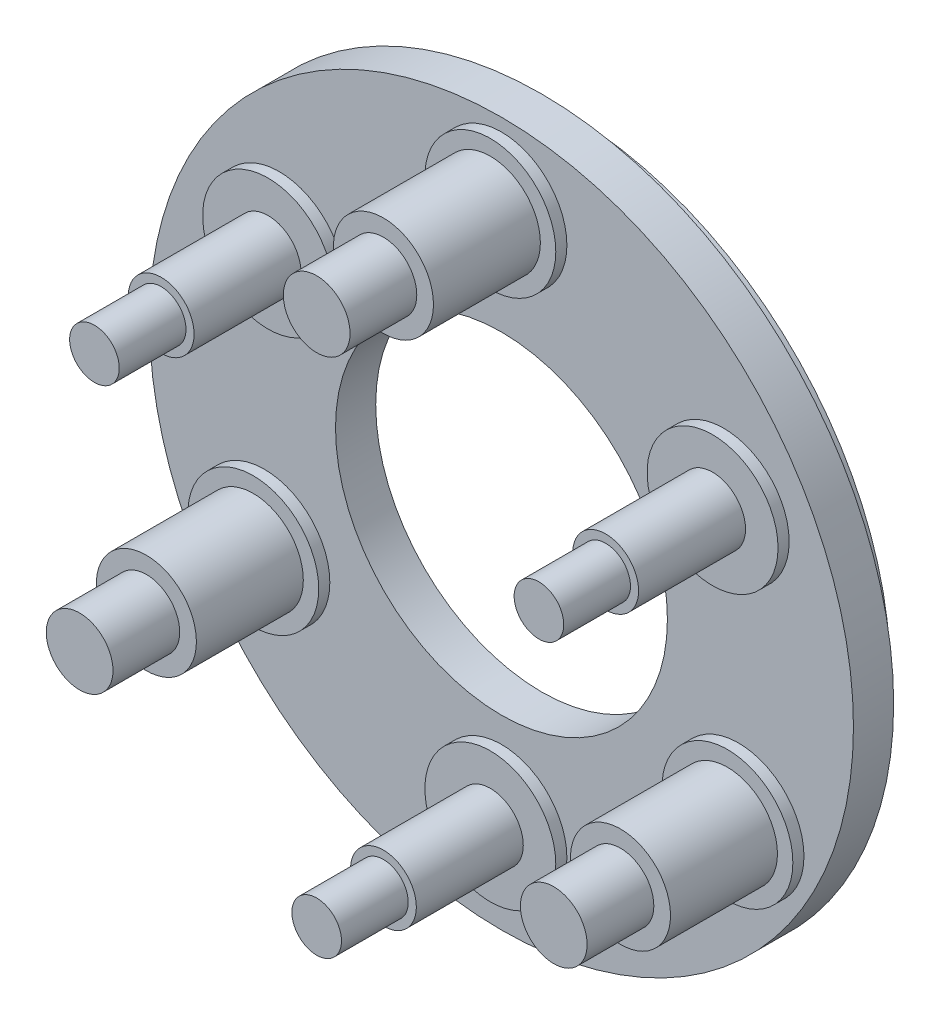
ISO-10303-21;
HEADER;
FILE_DESCRIPTION(('STEP AP214'),'2;1');
FILE_NAME('part.step','',(''),(''),'','','');
FILE_SCHEMA(('AUTOMOTIVE_DESIGN { 1 0 10303 214 1 1 1 1 }'));
ENDSEC;
DATA;
#1=APPLICATION_CONTEXT('core data for automotive mechanical design processes');
#2=APPLICATION_PROTOCOL_DEFINITION('international standard','automotive_design',2000,#1);
#3=PRODUCT_CONTEXT('',#1,'mechanical');
#4=PRODUCT('Part','Part','',(#3));
#5=PRODUCT_RELATED_PRODUCT_CATEGORY('part','',(#4));
#6=PRODUCT_DEFINITION_FORMATION('','',#4);
#7=PRODUCT_DEFINITION_CONTEXT('part definition',#1,'design');
#8=PRODUCT_DEFINITION('design','',#6,#7);
#9=PRODUCT_DEFINITION_SHAPE('','',#8);
#10=(LENGTH_UNIT() NAMED_UNIT(*) SI_UNIT(.MILLI.,.METRE.));
#11=(NAMED_UNIT(*) PLANE_ANGLE_UNIT() SI_UNIT($,.RADIAN.));
#12=(NAMED_UNIT(*) SI_UNIT($,.STERADIAN.) SOLID_ANGLE_UNIT());
#13=UNCERTAINTY_MEASURE_WITH_UNIT(LENGTH_MEASURE(1.E-05),#10,'distance_accuracy_value','');
#14=(GEOMETRIC_REPRESENTATION_CONTEXT(3) GLOBAL_UNCERTAINTY_ASSIGNED_CONTEXT((#13)) GLOBAL_UNIT_ASSIGNED_CONTEXT((#10,
#11,#12)) REPRESENTATION_CONTEXT('',''));
#15=CARTESIAN_POINT('',(0.,0.,0.));
#16=DIRECTION('',(0.,0.,1.));
#17=DIRECTION('',(1.,0.,0.));
#18=AXIS2_PLACEMENT_3D('',#15,#16,#17);
#19=CARTESIAN_POINT('',(0.,0.,0.));
#20=DIRECTION('',(0.,0.,1.));
#21=DIRECTION('',(1.,0.,0.));
#22=AXIS2_PLACEMENT_3D('',#19,#20,#21);
#23=PLANE('',#22);
#24=CARTESIAN_POINT('',(0.,0.,0.));
#25=DIRECTION('',(0.,0.,1.));
#26=DIRECTION('',(1.,0.,0.));
#27=AXIS2_PLACEMENT_3D('',#24,#25,#26);
#28=CIRCLE('',#27,4.9276);
#29=CARTESIAN_POINT('',(4.9276,0.,0.));
#30=VERTEX_POINT('',#29);
#31=EDGE_CURVE('E53',#30,#30,#28,.T.);
#32=ORIENTED_EDGE('',*,*,#31,.T.);
#33=EDGE_LOOP('',(#32));
#34=FACE_BOUND('',#33,.T.);
#35=CARTESIAN_POINT('',(0.,0.,0.));
#36=DIRECTION('',(0.,0.,-1.));
#37=DIRECTION('',(-1.,0.,0.));
#38=AXIS2_PLACEMENT_3D('',#35,#36,#37);
#39=CIRCLE('',#38,8.89);
#40=CARTESIAN_POINT('',(-8.89,0.,0.));
#41=VERTEX_POINT('',#40);
#42=EDGE_CURVE('E62',#41,#41,#39,.T.);
#43=ORIENTED_EDGE('',*,*,#42,.T.);
#44=EDGE_LOOP('',(#43));
#45=FACE_BOUND('',#44,.T.);
#46=ADVANCED_FACE('F35',(#34,#45),#23,.F.);
#47=CARTESIAN_POINT('',(0.,0.,1.1938));
#48=DIRECTION('',(0.,0.,1.));
#49=DIRECTION('',(1.,0.,0.));
#50=AXIS2_PLACEMENT_3D('',#47,#48,#49);
#51=PLANE('',#50);
#52=CARTESIAN_POINT('',(-6.59911357683746,3.80999999999994,1.1938));
#53=DIRECTION('',(0.,0.,1.));
#54=DIRECTION('',(-0.499999999999992,-0.866025403784443,0.));
#55=AXIS2_PLACEMENT_3D('',#52,#53,#54);
#56=CIRCLE('',#55,1.9431);
#57=CARTESIAN_POINT('',(-7.57066357683744,2.12722603790639,1.1938));
#58=VERTEX_POINT('',#57);
#59=EDGE_CURVE('E122',#58,#58,#56,.T.);
#60=ORIENTED_EDGE('',*,*,#59,.F.);
#61=EDGE_LOOP('',(#60));
#62=FACE_BOUND('',#61,.T.);
#63=CARTESIAN_POINT('',(7.03905448195995,-4.06399999999994,1.1938));
#64=DIRECTION('',(0.,0.,1.));
#65=DIRECTION('',(-0.499999999999992,-0.866025403784443,0.));
#66=AXIS2_PLACEMENT_3D('',#63,#64,#65);
#67=CIRCLE('',#66,1.9431);
#68=CARTESIAN_POINT('',(6.06750448195997,-5.74677396209349,1.1938));
#69=VERTEX_POINT('',#68);
#70=EDGE_CURVE('E116',#69,#69,#67,.T.);
#71=ORIENTED_EDGE('',*,*,#70,.F.);
#72=EDGE_LOOP('',(#71));
#73=FACE_BOUND('',#72,.T.);
#74=CARTESIAN_POINT('',(6.5991135768374,3.81000000000003,1.1938));
#75=DIRECTION('',(0.,0.,1.));
#76=DIRECTION('',(-0.500000000000004,0.866025403784436,0.));
#77=AXIS2_PLACEMENT_3D('',#74,#75,#76);
#78=CIRCLE('',#77,1.9431);
#79=CARTESIAN_POINT('',(5.6275635768374,5.49277396209357,1.1938));
#80=VERTEX_POINT('',#79);
#81=EDGE_CURVE('E110',#80,#80,#78,.T.);
#82=ORIENTED_EDGE('',*,*,#81,.F.);
#83=EDGE_LOOP('',(#82));
#84=FACE_BOUND('',#83,.T.);
#85=CARTESIAN_POINT('',(-7.0390544819599,-4.06400000000003,1.1938));
#86=DIRECTION('',(0.,0.,1.));
#87=DIRECTION('',(-0.500000000000004,0.866025403784436,0.));
#88=AXIS2_PLACEMENT_3D('',#85,#86,#87);
#89=CIRCLE('',#88,1.9431);
#90=CARTESIAN_POINT('',(-8.01060448195991,-2.38122603790649,1.1938));
#91=VERTEX_POINT('',#90);
#92=EDGE_CURVE('E104',#91,#91,#89,.T.);
#93=ORIENTED_EDGE('',*,*,#92,.F.);
#94=EDGE_LOOP('',(#93));
#95=FACE_BOUND('',#94,.T.);
#96=CARTESIAN_POINT('',(0.,-7.62,1.1938));
#97=DIRECTION('',(0.,0.,1.));
#98=DIRECTION('',(1.,0.,0.));
#99=AXIS2_PLACEMENT_3D('',#96,#97,#98);
#100=CIRCLE('',#99,1.9431);
#101=CARTESIAN_POINT('',(1.9431,-7.62,1.1938));
#102=VERTEX_POINT('',#101);
#103=EDGE_CURVE('E74',#102,#102,#100,.T.);
#104=ORIENTED_EDGE('',*,*,#103,.F.);
#105=EDGE_LOOP('',(#104));
#106=FACE_BOUND('',#105,.T.);
#107=CARTESIAN_POINT('',(0.,8.128,1.1938));
#108=DIRECTION('',(0.,0.,1.));
#109=DIRECTION('',(1.,0.,0.));
#110=AXIS2_PLACEMENT_3D('',#107,#108,#109);
#111=CIRCLE('',#110,1.9431);
#112=CARTESIAN_POINT('',(1.9431,8.128,1.1938));
#113=VERTEX_POINT('',#112);
#114=EDGE_CURVE('E68',#113,#113,#111,.T.);
#115=ORIENTED_EDGE('',*,*,#114,.F.);
#116=EDGE_LOOP('',(#115));
#117=FACE_BOUND('',#116,.T.);
#118=CARTESIAN_POINT('',(0.,0.,1.1938));
#119=DIRECTION('',(0.,0.,1.));
#120=DIRECTION('',(1.,0.,0.));
#121=AXIS2_PLACEMENT_3D('',#118,#119,#120);
#122=CIRCLE('',#121,10.4521);
#123=CARTESIAN_POINT('',(10.4521,0.,1.1938));
#124=VERTEX_POINT('',#123);
#125=EDGE_CURVE('E42',#124,#124,#122,.T.);
#126=ORIENTED_EDGE('',*,*,#125,.T.);
#127=EDGE_LOOP('',(#126));
#128=FACE_BOUND('',#127,.T.);
#129=CARTESIAN_POINT('',(0.,0.,1.1938));
#130=DIRECTION('',(0.,0.,1.));
#131=DIRECTION('',(1.,0.,0.));
#132=AXIS2_PLACEMENT_3D('',#129,#130,#131);
#133=CIRCLE('',#132,4.9276);
#134=CARTESIAN_POINT('',(4.9276,0.,1.1938));
#135=VERTEX_POINT('',#134);
#136=EDGE_CURVE('E51',#135,#135,#133,.T.);
#137=ORIENTED_EDGE('',*,*,#136,.F.);
#138=EDGE_LOOP('',(#137));
#139=FACE_BOUND('',#138,.T.);
#140=ADVANCED_FACE('F213',(#62,#73,#84,#95,#106,#117,#128,#139),#51,.T.);
#141=CARTESIAN_POINT('',(0.,0.,0.));
#142=DIRECTION('',(0.,0.,1.));
#143=DIRECTION('',(1.,0.,0.));
#144=AXIS2_PLACEMENT_3D('',#141,#142,#143);
#145=CIRCLE('',#144,9.6393);
#146=CARTESIAN_POINT('',(9.6393,0.,0.));
#147=VERTEX_POINT('',#146);
#148=EDGE_CURVE('E10',#147,#147,#145,.F.);
#149=ORIENTED_EDGE('',*,*,#148,.F.);
#150=EDGE_LOOP('',(#149));
#151=FACE_BOUND('',#150,.T.);
#152=CARTESIAN_POINT('',(0.,0.,0.));
#153=DIRECTION('',(0.,0.,1.));
#154=DIRECTION('',(1.,0.,0.));
#155=AXIS2_PLACEMENT_3D('',#152,#153,#154);
#156=CIRCLE('',#155,10.4521);
#157=CARTESIAN_POINT('',(10.4521,0.,0.));
#158=VERTEX_POINT('',#157);
#159=EDGE_CURVE('E46',#158,#158,#156,.T.);
#160=ORIENTED_EDGE('',*,*,#159,.F.);
#161=EDGE_LOOP('',(#160));
#162=FACE_BOUND('',#161,.T.);
#163=ADVANCED_FACE('F216',(#151,#162),#23,.F.);
#164=CARTESIAN_POINT('',(0.,0.,1.1938));
#165=DIRECTION('',(0.,0.,-1.));
#166=DIRECTION('',(-1.,0.,0.));
#167=AXIS2_PLACEMENT_3D('',#164,#165,#166);
#168=CYLINDRICAL_SURFACE('',#167,10.4521);
#169=ORIENTED_EDGE('',*,*,#125,.F.);
#170=EDGE_LOOP('',(#169));
#171=FACE_BOUND('',#170,.T.);
#172=ORIENTED_EDGE('',*,*,#159,.T.);
#173=EDGE_LOOP('',(#172));
#174=FACE_BOUND('',#173,.T.);
#175=ADVANCED_FACE('F37',(#171,#174),#168,.T.);
#176=CARTESIAN_POINT('',(0.,0.,1.1938));
#177=DIRECTION('',(0.,0.,-1.));
#178=DIRECTION('',(-1.,0.,0.));
#179=AXIS2_PLACEMENT_3D('',#176,#177,#178);
#180=CYLINDRICAL_SURFACE('',#179,4.9276);
#181=ORIENTED_EDGE('',*,*,#136,.T.);
#182=EDGE_LOOP('',(#181));
#183=FACE_BOUND('',#182,.T.);
#184=ORIENTED_EDGE('',*,*,#31,.F.);
#185=EDGE_LOOP('',(#184));
#186=FACE_BOUND('',#185,.T.);
#187=ADVANCED_FACE('F230',(#183,#186),#180,.F.);
#188=CARTESIAN_POINT('',(0.,0.,-0.7112));
#189=DIRECTION('',(0.,0.,-1.));
#190=DIRECTION('',(-1.,0.,0.));
#191=AXIS2_PLACEMENT_3D('',#188,#189,#190);
#192=PLANE('',#191);
#193=CARTESIAN_POINT('',(0.,0.,-0.7112));
#194=DIRECTION('',(0.,0.,-1.));
#195=DIRECTION('',(-1.,0.,0.));
#196=AXIS2_PLACEMENT_3D('',#193,#194,#195);
#197=CIRCLE('',#196,9.6393);
#198=CARTESIAN_POINT('',(-9.6393,0.,-0.7112));
#199=VERTEX_POINT('',#198);
#200=EDGE_CURVE('E56',#199,#199,#197,.T.);
#201=ORIENTED_EDGE('',*,*,#200,.T.);
#202=EDGE_LOOP('',(#201));
#203=FACE_BOUND('',#202,.T.);
#204=CARTESIAN_POINT('',(0.,0.,-0.7112));
#205=DIRECTION('',(0.,0.,-1.));
#206=DIRECTION('',(-1.,0.,0.));
#207=AXIS2_PLACEMENT_3D('',#204,#205,#206);
#208=CIRCLE('',#207,8.89);
#209=CARTESIAN_POINT('',(-8.89,0.,-0.7112));
#210=VERTEX_POINT('',#209);
#211=EDGE_CURVE('E61',#210,#210,#208,.T.);
#212=ORIENTED_EDGE('',*,*,#211,.F.);
#213=EDGE_LOOP('',(#212));
#214=FACE_BOUND('',#213,.T.);
#215=ADVANCED_FACE('F233',(#203,#214),#192,.T.);
#216=CARTESIAN_POINT('',(0.,0.,-0.7112));
#217=DIRECTION('',(0.,0.,1.));
#218=DIRECTION('',(1.,0.,0.));
#219=AXIS2_PLACEMENT_3D('',#216,#217,#218);
#220=CYLINDRICAL_SURFACE('',#219,9.6393);
#221=ORIENTED_EDGE('',*,*,#200,.F.);
#222=EDGE_LOOP('',(#221));
#223=FACE_BOUND('',#222,.T.);
#224=ORIENTED_EDGE('',*,*,#148,.T.);
#225=EDGE_LOOP('',(#224));
#226=FACE_BOUND('',#225,.T.);
#227=ADVANCED_FACE('F244',(#223,#226),#220,.T.);
#228=CARTESIAN_POINT('',(0.,0.,-0.7112));
#229=DIRECTION('',(0.,0.,1.));
#230=DIRECTION('',(1.,0.,0.));
#231=AXIS2_PLACEMENT_3D('',#228,#229,#230);
#232=CYLINDRICAL_SURFACE('',#231,8.89);
#233=ORIENTED_EDGE('',*,*,#211,.T.);
#234=EDGE_LOOP('',(#233));
#235=FACE_BOUND('',#234,.T.);
#236=ORIENTED_EDGE('',*,*,#42,.F.);
#237=EDGE_LOOP('',(#236));
#238=FACE_BOUND('',#237,.T.);
#239=ADVANCED_FACE('F241',(#235,#238),#232,.F.);
#240=CARTESIAN_POINT('',(0.,8.128,1.524));
#241=DIRECTION('',(0.,0.,-1.));
#242=DIRECTION('',(-1.,0.,0.));
#243=AXIS2_PLACEMENT_3D('',#240,#241,#242);
#244=CYLINDRICAL_SURFACE('',#243,1.9431);
#245=CARTESIAN_POINT('',(0.,8.128,1.524));
#246=DIRECTION('',(0.,0.,1.));
#247=DIRECTION('',(1.,0.,0.));
#248=AXIS2_PLACEMENT_3D('',#245,#246,#247);
#249=CIRCLE('',#248,1.9431);
#250=CARTESIAN_POINT('',(1.9431,8.128,1.524));
#251=VERTEX_POINT('',#250);
#252=EDGE_CURVE('E65',#251,#251,#249,.T.);
#253=ORIENTED_EDGE('',*,*,#252,.F.);
#254=EDGE_LOOP('',(#253));
#255=FACE_BOUND('',#254,.T.);
#256=ORIENTED_EDGE('',*,*,#114,.T.);
#257=EDGE_LOOP('',(#256));
#258=FACE_BOUND('',#257,.T.);
#259=ADVANCED_FACE('F243',(#255,#258),#244,.T.);
#260=CARTESIAN_POINT('',(0.,8.128,1.524));
#261=DIRECTION('',(0.,0.,1.));
#262=DIRECTION('',(1.,0.,0.));
#263=AXIS2_PLACEMENT_3D('',#260,#261,#262);
#264=PLANE('',#263);
#265=CARTESIAN_POINT('',(0.,8.128,1.524));
#266=DIRECTION('',(0.,0.,1.));
#267=DIRECTION('',(1.,0.,0.));
#268=AXIS2_PLACEMENT_3D('',#265,#266,#267);
#269=CIRCLE('',#268,1.4859);
#270=CARTESIAN_POINT('',(1.4859,8.128,1.524));
#271=VERTEX_POINT('',#270);
#272=EDGE_CURVE('E80',#271,#271,#269,.T.);
#273=ORIENTED_EDGE('',*,*,#272,.F.);
#274=EDGE_LOOP('',(#273));
#275=FACE_BOUND('',#274,.T.);
#276=ORIENTED_EDGE('',*,*,#252,.T.);
#277=EDGE_LOOP('',(#276));
#278=FACE_BOUND('',#277,.T.);
#279=ADVANCED_FACE('F251',(#275,#278),#264,.T.);
#280=CARTESIAN_POINT('',(0.,-7.62,1.524));
#281=DIRECTION('',(0.,0.,-1.));
#282=DIRECTION('',(-1.,0.,0.));
#283=AXIS2_PLACEMENT_3D('',#280,#281,#282);
#284=CYLINDRICAL_SURFACE('',#283,1.9431);
#285=CARTESIAN_POINT('',(0.,-7.62,1.524));
#286=DIRECTION('',(0.,0.,1.));
#287=DIRECTION('',(1.,0.,0.));
#288=AXIS2_PLACEMENT_3D('',#285,#286,#287);
#289=CIRCLE('',#288,1.9431);
#290=CARTESIAN_POINT('',(1.9431,-7.62,1.524));
#291=VERTEX_POINT('',#290);
#292=EDGE_CURVE('E71',#291,#291,#289,.T.);
#293=ORIENTED_EDGE('',*,*,#292,.F.);
#294=EDGE_LOOP('',(#293));
#295=FACE_BOUND('',#294,.T.);
#296=ORIENTED_EDGE('',*,*,#103,.T.);
#297=EDGE_LOOP('',(#296));
#298=FACE_BOUND('',#297,.T.);
#299=ADVANCED_FACE('F301',(#295,#298),#284,.T.);
#300=CARTESIAN_POINT('',(0.,-7.62,1.524));
#301=DIRECTION('',(0.,0.,1.));
#302=DIRECTION('',(1.,0.,0.));
#303=AXIS2_PLACEMENT_3D('',#300,#301,#302);
#304=PLANE('',#303);
#305=CARTESIAN_POINT('',(0.,-7.62,1.524));
#306=DIRECTION('',(0.,0.,1.));
#307=DIRECTION('',(1.,0.,0.));
#308=AXIS2_PLACEMENT_3D('',#305,#306,#307);
#309=CIRCLE('',#308,0.9779);
#310=CARTESIAN_POINT('',(0.977900000000002,-7.62,1.524));
#311=VERTEX_POINT('',#310);
#312=EDGE_CURVE('E86',#311,#311,#309,.T.);
#313=ORIENTED_EDGE('',*,*,#312,.F.);
#314=EDGE_LOOP('',(#313));
#315=FACE_BOUND('',#314,.T.);
#316=ORIENTED_EDGE('',*,*,#292,.T.);
#317=EDGE_LOOP('',(#316));
#318=FACE_BOUND('',#317,.T.);
#319=ADVANCED_FACE('F308',(#315,#318),#304,.T.);
#320=CARTESIAN_POINT('',(0.,8.128,4.699));
#321=DIRECTION('',(0.,0.,-1.));
#322=DIRECTION('',(-1.,0.,0.));
#323=AXIS2_PLACEMENT_3D('',#320,#321,#322);
#324=CYLINDRICAL_SURFACE('',#323,1.4859);
#325=CARTESIAN_POINT('',(0.,8.128,4.699));
#326=DIRECTION('',(0.,0.,1.));
#327=DIRECTION('',(1.,0.,0.));
#328=AXIS2_PLACEMENT_3D('',#325,#326,#327);
#329=CIRCLE('',#328,1.4859);
#330=CARTESIAN_POINT('',(1.4859,8.128,4.699));
#331=VERTEX_POINT('',#330);
#332=EDGE_CURVE('E77',#331,#331,#329,.T.);
#333=ORIENTED_EDGE('',*,*,#332,.F.);
#334=EDGE_LOOP('',(#333));
#335=FACE_BOUND('',#334,.T.);
#336=ORIENTED_EDGE('',*,*,#272,.T.);
#337=EDGE_LOOP('',(#336));
#338=FACE_BOUND('',#337,.T.);
#339=ADVANCED_FACE('F315',(#335,#338),#324,.T.);
#340=CARTESIAN_POINT('',(0.,8.128,4.699));
#341=DIRECTION('',(0.,0.,1.));
#342=DIRECTION('',(1.,0.,0.));
#343=AXIS2_PLACEMENT_3D('',#340,#341,#342);
#344=PLANE('',#343);
#345=CARTESIAN_POINT('',(0.,8.128,4.699));
#346=DIRECTION('',(0.,0.,1.));
#347=DIRECTION('',(1.,0.,0.));
#348=AXIS2_PLACEMENT_3D('',#345,#346,#347);
#349=CIRCLE('',#348,0.9906);
#350=CARTESIAN_POINT('',(0.9906,8.128,4.699));
#351=VERTEX_POINT('',#350);
#352=EDGE_CURVE('E92',#351,#351,#349,.T.);
#353=ORIENTED_EDGE('',*,*,#352,.F.);
#354=EDGE_LOOP('',(#353));
#355=FACE_BOUND('',#354,.T.);
#356=ORIENTED_EDGE('',*,*,#332,.T.);
#357=EDGE_LOOP('',(#356));
#358=FACE_BOUND('',#357,.T.);
#359=ADVANCED_FACE('F323',(#355,#358),#344,.T.);
#360=CARTESIAN_POINT('',(0.,-7.62,4.699));
#361=DIRECTION('',(0.,0.,-1.));
#362=DIRECTION('',(-1.,0.,0.));
#363=AXIS2_PLACEMENT_3D('',#360,#361,#362);
#364=CYLINDRICAL_SURFACE('',#363,0.9779);
#365=CARTESIAN_POINT('',(0.,-7.62,4.699));
#366=DIRECTION('',(0.,0.,1.));
#367=DIRECTION('',(1.,0.,0.));
#368=AXIS2_PLACEMENT_3D('',#365,#366,#367);
#369=CIRCLE('',#368,0.9779);
#370=CARTESIAN_POINT('',(0.977900000000002,-7.62,4.699));
#371=VERTEX_POINT('',#370);
#372=EDGE_CURVE('E83',#371,#371,#369,.T.);
#373=ORIENTED_EDGE('',*,*,#372,.F.);
#374=EDGE_LOOP('',(#373));
#375=FACE_BOUND('',#374,.T.);
#376=ORIENTED_EDGE('',*,*,#312,.T.);
#377=EDGE_LOOP('',(#376));
#378=FACE_BOUND('',#377,.T.);
#379=ADVANCED_FACE('F332',(#375,#378),#364,.T.);
#380=CARTESIAN_POINT('',(0.,-7.62,4.699));
#381=DIRECTION('',(0.,0.,1.));
#382=DIRECTION('',(1.,0.,0.));
#383=AXIS2_PLACEMENT_3D('',#380,#381,#382);
#384=PLANE('',#383);
#385=CARTESIAN_POINT('',(0.,-7.62,4.699));
#386=DIRECTION('',(0.,0.,1.));
#387=DIRECTION('',(1.,0.,0.));
#388=AXIS2_PLACEMENT_3D('',#385,#386,#387);
#389=CIRCLE('',#388,0.7366);
#390=CARTESIAN_POINT('',(0.736600000000002,-7.62,4.699));
#391=VERTEX_POINT('',#390);
#392=EDGE_CURVE('E98',#391,#391,#389,.T.);
#393=ORIENTED_EDGE('',*,*,#392,.F.);
#394=EDGE_LOOP('',(#393));
#395=FACE_BOUND('',#394,.T.);
#396=ORIENTED_EDGE('',*,*,#372,.T.);
#397=EDGE_LOOP('',(#396));
#398=FACE_BOUND('',#397,.T.);
#399=ADVANCED_FACE('F340',(#395,#398),#384,.T.);
#400=CARTESIAN_POINT('',(0.,8.128,6.6802));
#401=DIRECTION('',(0.,0.,-1.));
#402=DIRECTION('',(-1.,0.,0.));
#403=AXIS2_PLACEMENT_3D('',#400,#401,#402);
#404=CYLINDRICAL_SURFACE('',#403,0.9906);
#405=CARTESIAN_POINT('',(0.,8.128,6.6802));
#406=DIRECTION('',(0.,0.,1.));
#407=DIRECTION('',(1.,0.,0.));
#408=AXIS2_PLACEMENT_3D('',#405,#406,#407);
#409=CIRCLE('',#408,0.9906);
#410=CARTESIAN_POINT('',(0.9906,8.128,6.6802));
#411=VERTEX_POINT('',#410);
#412=EDGE_CURVE('E89',#411,#411,#409,.T.);
#413=ORIENTED_EDGE('',*,*,#412,.F.);
#414=EDGE_LOOP('',(#413));
#415=FACE_BOUND('',#414,.T.);
#416=ORIENTED_EDGE('',*,*,#352,.T.);
#417=EDGE_LOOP('',(#416));
#418=FACE_BOUND('',#417,.T.);
#419=ADVANCED_FACE('F347',(#415,#418),#404,.T.);
#420=CARTESIAN_POINT('',(0.,8.128,6.6802));
#421=DIRECTION('',(0.,0.,1.));
#422=DIRECTION('',(1.,0.,0.));
#423=AXIS2_PLACEMENT_3D('',#420,#421,#422);
#424=PLANE('',#423);
#425=ORIENTED_EDGE('',*,*,#412,.T.);
#426=EDGE_LOOP('',(#425));
#427=FACE_BOUND('',#426,.T.);
#428=ADVANCED_FACE('F355',(#427),#424,.T.);
#429=CARTESIAN_POINT('',(0.,-7.62,6.6802));
#430=DIRECTION('',(0.,0.,-1.));
#431=DIRECTION('',(-1.,0.,0.));
#432=AXIS2_PLACEMENT_3D('',#429,#430,#431);
#433=CYLINDRICAL_SURFACE('',#432,0.7366);
#434=CARTESIAN_POINT('',(0.,-7.62,6.6802));
#435=DIRECTION('',(0.,0.,1.));
#436=DIRECTION('',(1.,0.,0.));
#437=AXIS2_PLACEMENT_3D('',#434,#435,#436);
#438=CIRCLE('',#437,0.7366);
#439=CARTESIAN_POINT('',(0.736600000000002,-7.62,6.6802));
#440=VERTEX_POINT('',#439);
#441=EDGE_CURVE('E95',#440,#440,#438,.T.);
#442=ORIENTED_EDGE('',*,*,#441,.F.);
#443=EDGE_LOOP('',(#442));
#444=FACE_BOUND('',#443,.T.);
#445=ORIENTED_EDGE('',*,*,#392,.T.);
#446=EDGE_LOOP('',(#445));
#447=FACE_BOUND('',#446,.T.);
#448=ADVANCED_FACE('F363',(#444,#447),#433,.T.);
#449=CARTESIAN_POINT('',(0.,-7.62,6.6802));
#450=DIRECTION('',(0.,0.,1.));
#451=DIRECTION('',(1.,0.,0.));
#452=AXIS2_PLACEMENT_3D('',#449,#450,#451);
#453=PLANE('',#452);
#454=ORIENTED_EDGE('',*,*,#441,.T.);
#455=EDGE_LOOP('',(#454));
#456=FACE_BOUND('',#455,.T.);
#457=ADVANCED_FACE('F371',(#456),#453,.T.);
#458=CARTESIAN_POINT('',(-7.0390544819599,-4.06400000000003,1.524));
#459=DIRECTION('',(0.,0.,-1.));
#460=DIRECTION('',(-1.,0.,0.));
#461=AXIS2_PLACEMENT_3D('',#458,#459,#460);
#462=CYLINDRICAL_SURFACE('',#461,1.9431);
#463=CARTESIAN_POINT('',(-7.0390544819599,-4.06400000000003,1.524));
#464=DIRECTION('',(0.,0.,1.));
#465=DIRECTION('',(-0.500000000000004,0.866025403784436,0.));
#466=AXIS2_PLACEMENT_3D('',#463,#464,#465);
#467=CIRCLE('',#466,1.9431);
#468=CARTESIAN_POINT('',(-8.01060448195991,-2.38122603790649,1.524));
#469=VERTEX_POINT('',#468);
#470=EDGE_CURVE('E101',#469,#469,#467,.T.);
#471=ORIENTED_EDGE('',*,*,#470,.F.);
#472=EDGE_LOOP('',(#471));
#473=FACE_BOUND('',#472,.T.);
#474=ORIENTED_EDGE('',*,*,#92,.T.);
#475=EDGE_LOOP('',(#474));
#476=FACE_BOUND('',#475,.T.);
#477=ADVANCED_FACE('F379',(#473,#476),#462,.T.);
#478=CARTESIAN_POINT('',(-7.0390544819599,-4.06400000000003,1.524));
#479=DIRECTION('',(0.,0.,1.));
#480=DIRECTION('',(-0.500000000000004,0.866025403784436,0.));
#481=AXIS2_PLACEMENT_3D('',#478,#479,#480);
#482=PLANE('',#481);
#483=CARTESIAN_POINT('',(-7.0390544819599,-4.06400000000003,1.524));
#484=DIRECTION('',(0.,0.,1.));
#485=DIRECTION('',(-0.500000000000004,0.866025403784436,0.));
#486=AXIS2_PLACEMENT_3D('',#483,#484,#485);
#487=CIRCLE('',#486,1.4859);
#488=CARTESIAN_POINT('',(-7.78200448195991,-2.77717285251674,1.524));
#489=VERTEX_POINT('',#488);
#490=EDGE_CURVE('E128',#489,#489,#487,.T.);
#491=ORIENTED_EDGE('',*,*,#490,.F.);
#492=EDGE_LOOP('',(#491));
#493=FACE_BOUND('',#492,.T.);
#494=ORIENTED_EDGE('',*,*,#470,.T.);
#495=EDGE_LOOP('',(#494));
#496=FACE_BOUND('',#495,.T.);
#497=ADVANCED_FACE('F387',(#493,#496),#482,.T.);
#498=CARTESIAN_POINT('',(6.5991135768374,3.81000000000003,1.524));
#499=DIRECTION('',(0.,0.,-1.));
#500=DIRECTION('',(-1.,0.,0.));
#501=AXIS2_PLACEMENT_3D('',#498,#499,#500);
#502=CYLINDRICAL_SURFACE('',#501,1.9431);
#503=CARTESIAN_POINT('',(6.5991135768374,3.81000000000003,1.524));
#504=DIRECTION('',(0.,0.,1.));
#505=DIRECTION('',(-0.500000000000004,0.866025403784436,0.));
#506=AXIS2_PLACEMENT_3D('',#503,#504,#505);
#507=CIRCLE('',#506,1.9431);
#508=CARTESIAN_POINT('',(5.6275635768374,5.49277396209357,1.524));
#509=VERTEX_POINT('',#508);
#510=EDGE_CURVE('E107',#509,#509,#507,.T.);
#511=ORIENTED_EDGE('',*,*,#510,.F.);
#512=EDGE_LOOP('',(#511));
#513=FACE_BOUND('',#512,.T.);
#514=ORIENTED_EDGE('',*,*,#81,.T.);
#515=EDGE_LOOP('',(#514));
#516=FACE_BOUND('',#515,.T.);
#517=ADVANCED_FACE('F395',(#513,#516),#502,.T.);
#518=CARTESIAN_POINT('',(6.5991135768374,3.81000000000003,1.524));
#519=DIRECTION('',(0.,0.,1.));
#520=DIRECTION('',(-0.500000000000004,0.866025403784436,0.));
#521=AXIS2_PLACEMENT_3D('',#518,#519,#520);
#522=PLANE('',#521);
#523=CARTESIAN_POINT('',(6.5991135768374,3.81000000000003,1.524));
#524=DIRECTION('',(0.,0.,1.));
#525=DIRECTION('',(-0.500000000000004,0.866025403784436,0.));
#526=AXIS2_PLACEMENT_3D('',#523,#524,#525);
#527=CIRCLE('',#526,0.9779);
#528=CARTESIAN_POINT('',(6.1101635768374,4.65688624236083,1.524));
#529=VERTEX_POINT('',#528);
#530=EDGE_CURVE('E134',#529,#529,#527,.T.);
#531=ORIENTED_EDGE('',*,*,#530,.F.);
#532=EDGE_LOOP('',(#531));
#533=FACE_BOUND('',#532,.T.);
#534=ORIENTED_EDGE('',*,*,#510,.T.);
#535=EDGE_LOOP('',(#534));
#536=FACE_BOUND('',#535,.T.);
#537=ADVANCED_FACE('F403',(#533,#536),#522,.T.);
#538=CARTESIAN_POINT('',(7.03905448195995,-4.06399999999994,1.524));
#539=DIRECTION('',(0.,0.,-1.));
#540=DIRECTION('',(-1.,0.,0.));
#541=AXIS2_PLACEMENT_3D('',#538,#539,#540);
#542=CYLINDRICAL_SURFACE('',#541,1.9431);
#543=CARTESIAN_POINT('',(7.03905448195995,-4.06399999999994,1.524));
#544=DIRECTION('',(0.,0.,1.));
#545=DIRECTION('',(-0.499999999999992,-0.866025403784443,0.));
#546=AXIS2_PLACEMENT_3D('',#543,#544,#545);
#547=CIRCLE('',#546,1.9431);
#548=CARTESIAN_POINT('',(6.06750448195997,-5.74677396209349,1.524));
#549=VERTEX_POINT('',#548);
#550=EDGE_CURVE('E113',#549,#549,#547,.T.);
#551=ORIENTED_EDGE('',*,*,#550,.F.);
#552=EDGE_LOOP('',(#551));
#553=FACE_BOUND('',#552,.T.);
#554=ORIENTED_EDGE('',*,*,#70,.T.);
#555=EDGE_LOOP('',(#554));
#556=FACE_BOUND('',#555,.T.);
#557=ADVANCED_FACE('F411',(#553,#556),#542,.T.);
#558=CARTESIAN_POINT('',(7.03905448195995,-4.06399999999994,1.524));
#559=DIRECTION('',(0.,0.,1.));
#560=DIRECTION('',(-0.499999999999992,-0.866025403784443,0.));
#561=AXIS2_PLACEMENT_3D('',#558,#559,#560);
#562=PLANE('',#561);
#563=CARTESIAN_POINT('',(7.03905448195995,-4.06399999999994,1.524));
#564=DIRECTION('',(0.,0.,1.));
#565=DIRECTION('',(-0.499999999999992,-0.866025403784443,0.));
#566=AXIS2_PLACEMENT_3D('',#563,#564,#565);
#567=CIRCLE('',#566,1.4859);
#568=CARTESIAN_POINT('',(6.29610448195997,-5.35082714748324,1.524));
#569=VERTEX_POINT('',#568);
#570=EDGE_CURVE('E140',#569,#569,#567,.T.);
#571=ORIENTED_EDGE('',*,*,#570,.F.);
#572=EDGE_LOOP('',(#571));
#573=FACE_BOUND('',#572,.T.);
#574=ORIENTED_EDGE('',*,*,#550,.T.);
#575=EDGE_LOOP('',(#574));
#576=FACE_BOUND('',#575,.T.);
#577=ADVANCED_FACE('F209',(#573,#576),#562,.T.);
#578=CARTESIAN_POINT('',(-6.59911357683746,3.80999999999994,1.524));
#579=DIRECTION('',(0.,0.,-1.));
#580=DIRECTION('',(-1.,0.,0.));
#581=AXIS2_PLACEMENT_3D('',#578,#579,#580);
#582=CYLINDRICAL_SURFACE('',#581,1.9431);
#583=CARTESIAN_POINT('',(-6.59911357683746,3.80999999999994,1.524));
#584=DIRECTION('',(0.,0.,1.));
#585=DIRECTION('',(-0.499999999999992,-0.866025403784443,0.));
#586=AXIS2_PLACEMENT_3D('',#583,#584,#585);
#587=CIRCLE('',#586,1.9431);
#588=CARTESIAN_POINT('',(-7.57066357683744,2.12722603790639,1.524));
#589=VERTEX_POINT('',#588);
#590=EDGE_CURVE('E119',#589,#589,#587,.T.);
#591=ORIENTED_EDGE('',*,*,#590,.F.);
#592=EDGE_LOOP('',(#591));
#593=FACE_BOUND('',#592,.T.);
#594=ORIENTED_EDGE('',*,*,#59,.T.);
#595=EDGE_LOOP('',(#594));
#596=FACE_BOUND('',#595,.T.);
#597=ADVANCED_FACE('F203',(#593,#596),#582,.T.);
#598=CARTESIAN_POINT('',(-6.59911357683746,3.80999999999994,1.524));
#599=DIRECTION('',(0.,0.,1.));
#600=DIRECTION('',(-0.499999999999992,-0.866025403784443,0.));
#601=AXIS2_PLACEMENT_3D('',#598,#599,#600);
#602=PLANE('',#601);
#603=CARTESIAN_POINT('',(-6.59911357683746,3.80999999999994,1.524));
#604=DIRECTION('',(0.,0.,1.));
#605=DIRECTION('',(-0.499999999999992,-0.866025403784443,0.));
#606=AXIS2_PLACEMENT_3D('',#603,#604,#605);
#607=CIRCLE('',#606,0.9779);
#608=CARTESIAN_POINT('',(-7.08806357683745,2.96311375763913,1.524));
#609=VERTEX_POINT('',#608);
#610=EDGE_CURVE('E146',#609,#609,#607,.T.);
#611=ORIENTED_EDGE('',*,*,#610,.F.);
#612=EDGE_LOOP('',(#611));
#613=FACE_BOUND('',#612,.T.);
#614=ORIENTED_EDGE('',*,*,#590,.T.);
#615=EDGE_LOOP('',(#614));
#616=FACE_BOUND('',#615,.T.);
#617=ADVANCED_FACE('F199',(#613,#616),#602,.T.);
#618=CARTESIAN_POINT('',(-7.0390544819599,-4.06400000000003,4.699));
#619=DIRECTION('',(0.,0.,-1.));
#620=DIRECTION('',(-1.,0.,0.));
#621=AXIS2_PLACEMENT_3D('',#618,#619,#620);
#622=CYLINDRICAL_SURFACE('',#621,1.4859);
#623=CARTESIAN_POINT('',(-7.0390544819599,-4.06400000000003,4.699));
#624=DIRECTION('',(0.,0.,1.));
#625=DIRECTION('',(-0.500000000000004,0.866025403784436,0.));
#626=AXIS2_PLACEMENT_3D('',#623,#624,#625);
#627=CIRCLE('',#626,1.4859);
#628=CARTESIAN_POINT('',(-7.78200448195991,-2.77717285251674,4.699));
#629=VERTEX_POINT('',#628);
#630=EDGE_CURVE('E125',#629,#629,#627,.T.);
#631=ORIENTED_EDGE('',*,*,#630,.F.);
#632=EDGE_LOOP('',(#631));
#633=FACE_BOUND('',#632,.T.);
#634=ORIENTED_EDGE('',*,*,#490,.T.);
#635=EDGE_LOOP('',(#634));
#636=FACE_BOUND('',#635,.T.);
#637=ADVANCED_FACE('F202',(#633,#636),#622,.T.);
#638=CARTESIAN_POINT('',(-7.0390544819599,-4.06400000000003,4.699));
#639=DIRECTION('',(0.,0.,1.));
#640=DIRECTION('',(-0.500000000000004,0.866025403784436,0.));
#641=AXIS2_PLACEMENT_3D('',#638,#639,#640);
#642=PLANE('',#641);
#643=CARTESIAN_POINT('',(-7.0390544819599,-4.06400000000003,4.699));
#644=DIRECTION('',(0.,0.,1.));
#645=DIRECTION('',(-0.500000000000004,0.866025403784436,0.));
#646=AXIS2_PLACEMENT_3D('',#643,#644,#645);
#647=CIRCLE('',#646,0.9906);
#648=CARTESIAN_POINT('',(-7.5343544819599,-3.20611523501117,4.699));
#649=VERTEX_POINT('',#648);
#650=EDGE_CURVE('E152',#649,#649,#647,.T.);
#651=ORIENTED_EDGE('',*,*,#650,.F.);
#652=EDGE_LOOP('',(#651));
#653=FACE_BOUND('',#652,.T.);
#654=ORIENTED_EDGE('',*,*,#630,.T.);
#655=EDGE_LOOP('',(#654));
#656=FACE_BOUND('',#655,.T.);
#657=ADVANCED_FACE('F441',(#653,#656),#642,.T.);
#658=CARTESIAN_POINT('',(6.5991135768374,3.81000000000003,4.699));
#659=DIRECTION('',(0.,0.,-1.));
#660=DIRECTION('',(-1.,0.,0.));
#661=AXIS2_PLACEMENT_3D('',#658,#659,#660);
#662=CYLINDRICAL_SURFACE('',#661,0.9779);
#663=CARTESIAN_POINT('',(6.5991135768374,3.81000000000003,4.699));
#664=DIRECTION('',(0.,0.,1.));
#665=DIRECTION('',(-0.500000000000004,0.866025403784436,0.));
#666=AXIS2_PLACEMENT_3D('',#663,#664,#665);
#667=CIRCLE('',#666,0.9779);
#668=CARTESIAN_POINT('',(6.1101635768374,4.65688624236083,4.699));
#669=VERTEX_POINT('',#668);
#670=EDGE_CURVE('E131',#669,#669,#667,.T.);
#671=ORIENTED_EDGE('',*,*,#670,.F.);
#672=EDGE_LOOP('',(#671));
#673=FACE_BOUND('',#672,.T.);
#674=ORIENTED_EDGE('',*,*,#530,.T.);
#675=EDGE_LOOP('',(#674));
#676=FACE_BOUND('',#675,.T.);
#677=ADVANCED_FACE('F449',(#673,#676),#662,.T.);
#678=CARTESIAN_POINT('',(6.5991135768374,3.81000000000003,4.699));
#679=DIRECTION('',(0.,0.,1.));
#680=DIRECTION('',(-0.500000000000004,0.866025403784436,0.));
#681=AXIS2_PLACEMENT_3D('',#678,#679,#680);
#682=PLANE('',#681);
#683=CARTESIAN_POINT('',(6.5991135768374,3.81000000000003,4.699));
#684=DIRECTION('',(0.,0.,1.));
#685=DIRECTION('',(-0.500000000000004,0.866025403784436,0.));
#686=AXIS2_PLACEMENT_3D('',#683,#684,#685);
#687=CIRCLE('',#686,0.7366);
#688=CARTESIAN_POINT('',(6.2308135768374,4.44791431242765,4.699));
#689=VERTEX_POINT('',#688);
#690=EDGE_CURVE('E158',#689,#689,#687,.T.);
#691=ORIENTED_EDGE('',*,*,#690,.F.);
#692=EDGE_LOOP('',(#691));
#693=FACE_BOUND('',#692,.T.);
#694=ORIENTED_EDGE('',*,*,#670,.T.);
#695=EDGE_LOOP('',(#694));
#696=FACE_BOUND('',#695,.T.);
#697=ADVANCED_FACE('F457',(#693,#696),#682,.T.);
#698=CARTESIAN_POINT('',(7.03905448195995,-4.06399999999994,4.699));
#699=DIRECTION('',(0.,0.,-1.));
#700=DIRECTION('',(-1.,0.,0.));
#701=AXIS2_PLACEMENT_3D('',#698,#699,#700);
#702=CYLINDRICAL_SURFACE('',#701,1.4859);
#703=CARTESIAN_POINT('',(7.03905448195995,-4.06399999999994,4.699));
#704=DIRECTION('',(0.,0.,1.));
#705=DIRECTION('',(-0.499999999999992,-0.866025403784443,0.));
#706=AXIS2_PLACEMENT_3D('',#703,#704,#705);
#707=CIRCLE('',#706,1.4859);
#708=CARTESIAN_POINT('',(6.29610448195997,-5.35082714748324,4.699));
#709=VERTEX_POINT('',#708);
#710=EDGE_CURVE('E137',#709,#709,#707,.T.);
#711=ORIENTED_EDGE('',*,*,#710,.F.);
#712=EDGE_LOOP('',(#711));
#713=FACE_BOUND('',#712,.T.);
#714=ORIENTED_EDGE('',*,*,#570,.T.);
#715=EDGE_LOOP('',(#714));
#716=FACE_BOUND('',#715,.T.);
#717=ADVANCED_FACE('F465',(#713,#716),#702,.T.);
#718=CARTESIAN_POINT('',(7.03905448195995,-4.06399999999994,4.699));
#719=DIRECTION('',(0.,0.,1.));
#720=DIRECTION('',(-0.499999999999992,-0.866025403784443,0.));
#721=AXIS2_PLACEMENT_3D('',#718,#719,#720);
#722=PLANE('',#721);
#723=CARTESIAN_POINT('',(7.03905448195995,-4.06399999999994,4.699));
#724=DIRECTION('',(0.,0.,1.));
#725=DIRECTION('',(-0.499999999999992,-0.866025403784443,0.));
#726=AXIS2_PLACEMENT_3D('',#723,#724,#725);
#727=CIRCLE('',#726,0.9906);
#728=CARTESIAN_POINT('',(6.54375448195996,-4.9218847649888,4.699));
#729=VERTEX_POINT('',#728);
#730=EDGE_CURVE('E164',#729,#729,#727,.T.);
#731=ORIENTED_EDGE('',*,*,#730,.F.);
#732=EDGE_LOOP('',(#731));
#733=FACE_BOUND('',#732,.T.);
#734=ORIENTED_EDGE('',*,*,#710,.T.);
#735=EDGE_LOOP('',(#734));
#736=FACE_BOUND('',#735,.T.);
#737=ADVANCED_FACE('F195',(#733,#736),#722,.T.);
#738=CARTESIAN_POINT('',(-6.59911357683746,3.80999999999994,4.699));
#739=DIRECTION('',(0.,0.,-1.));
#740=DIRECTION('',(-1.,0.,0.));
#741=AXIS2_PLACEMENT_3D('',#738,#739,#740);
#742=CYLINDRICAL_SURFACE('',#741,0.9779);
#743=CARTESIAN_POINT('',(-6.59911357683746,3.80999999999994,4.699));
#744=DIRECTION('',(0.,0.,1.));
#745=DIRECTION('',(-0.499999999999992,-0.866025403784443,0.));
#746=AXIS2_PLACEMENT_3D('',#743,#744,#745);
#747=CIRCLE('',#746,0.9779);
#748=CARTESIAN_POINT('',(-7.08806357683745,2.96311375763913,4.699));
#749=VERTEX_POINT('',#748);
#750=EDGE_CURVE('E143',#749,#749,#747,.T.);
#751=ORIENTED_EDGE('',*,*,#750,.F.);
#752=EDGE_LOOP('',(#751));
#753=FACE_BOUND('',#752,.T.);
#754=ORIENTED_EDGE('',*,*,#610,.T.);
#755=EDGE_LOOP('',(#754));
#756=FACE_BOUND('',#755,.T.);
#757=ADVANCED_FACE('F189',(#753,#756),#742,.T.);
#758=CARTESIAN_POINT('',(-6.59911357683746,3.80999999999994,4.699));
#759=DIRECTION('',(0.,0.,1.));
#760=DIRECTION('',(-0.499999999999992,-0.866025403784443,0.));
#761=AXIS2_PLACEMENT_3D('',#758,#759,#760);
#762=PLANE('',#761);
#763=CARTESIAN_POINT('',(-6.59911357683746,3.80999999999994,4.699));
#764=DIRECTION('',(0.,0.,1.));
#765=DIRECTION('',(-0.499999999999992,-0.866025403784443,0.));
#766=AXIS2_PLACEMENT_3D('',#763,#764,#765);
#767=CIRCLE('',#766,0.7366);
#768=CARTESIAN_POINT('',(-6.96741357683745,3.17208568757232,4.699));
#769=VERTEX_POINT('',#768);
#770=EDGE_CURVE('E170',#769,#769,#767,.T.);
#771=ORIENTED_EDGE('',*,*,#770,.F.);
#772=EDGE_LOOP('',(#771));
#773=FACE_BOUND('',#772,.T.);
#774=ORIENTED_EDGE('',*,*,#750,.T.);
#775=EDGE_LOOP('',(#774));
#776=FACE_BOUND('',#775,.T.);
#777=ADVANCED_FACE('F185',(#773,#776),#762,.T.);
#778=CARTESIAN_POINT('',(-7.0390544819599,-4.06400000000003,6.6802));
#779=DIRECTION('',(0.,0.,-1.));
#780=DIRECTION('',(-1.,0.,0.));
#781=AXIS2_PLACEMENT_3D('',#778,#779,#780);
#782=CYLINDRICAL_SURFACE('',#781,0.9906);
#783=CARTESIAN_POINT('',(-7.0390544819599,-4.06400000000003,6.6802));
#784=DIRECTION('',(0.,0.,1.));
#785=DIRECTION('',(-0.500000000000004,0.866025403784436,0.));
#786=AXIS2_PLACEMENT_3D('',#783,#784,#785);
#787=CIRCLE('',#786,0.9906);
#788=CARTESIAN_POINT('',(-7.5343544819599,-3.20611523501117,6.6802));
#789=VERTEX_POINT('',#788);
#790=EDGE_CURVE('E149',#789,#789,#787,.T.);
#791=ORIENTED_EDGE('',*,*,#790,.F.);
#792=EDGE_LOOP('',(#791));
#793=FACE_BOUND('',#792,.T.);
#794=ORIENTED_EDGE('',*,*,#650,.T.);
#795=EDGE_LOOP('',(#794));
#796=FACE_BOUND('',#795,.T.);
#797=ADVANCED_FACE('F188',(#793,#796),#782,.T.);
#798=CARTESIAN_POINT('',(-7.0390544819599,-4.06400000000003,6.6802));
#799=DIRECTION('',(0.,0.,1.));
#800=DIRECTION('',(-0.500000000000004,0.866025403784436,0.));
#801=AXIS2_PLACEMENT_3D('',#798,#799,#800);
#802=PLANE('',#801);
#803=ORIENTED_EDGE('',*,*,#790,.T.);
#804=EDGE_LOOP('',(#803));
#805=FACE_BOUND('',#804,.T.);
#806=ADVANCED_FACE('F495',(#805),#802,.T.);
#807=CARTESIAN_POINT('',(6.5991135768374,3.81000000000003,6.6802));
#808=DIRECTION('',(0.,0.,-1.));
#809=DIRECTION('',(-1.,0.,0.));
#810=AXIS2_PLACEMENT_3D('',#807,#808,#809);
#811=CYLINDRICAL_SURFACE('',#810,0.7366);
#812=CARTESIAN_POINT('',(6.5991135768374,3.81000000000003,6.6802));
#813=DIRECTION('',(0.,0.,1.));
#814=DIRECTION('',(-0.500000000000004,0.866025403784436,0.));
#815=AXIS2_PLACEMENT_3D('',#812,#813,#814);
#816=CIRCLE('',#815,0.7366);
#817=CARTESIAN_POINT('',(6.2308135768374,4.44791431242765,6.6802));
#818=VERTEX_POINT('',#817);
#819=EDGE_CURVE('E155',#818,#818,#816,.T.);
#820=ORIENTED_EDGE('',*,*,#819,.F.);
#821=EDGE_LOOP('',(#820));
#822=FACE_BOUND('',#821,.T.);
#823=ORIENTED_EDGE('',*,*,#690,.T.);
#824=EDGE_LOOP('',(#823));
#825=FACE_BOUND('',#824,.T.);
#826=ADVANCED_FACE('F503',(#822,#825),#811,.T.);
#827=CARTESIAN_POINT('',(6.5991135768374,3.81000000000003,6.6802));
#828=DIRECTION('',(0.,0.,1.));
#829=DIRECTION('',(-0.500000000000004,0.866025403784436,0.));
#830=AXIS2_PLACEMENT_3D('',#827,#828,#829);
#831=PLANE('',#830);
#832=ORIENTED_EDGE('',*,*,#819,.T.);
#833=EDGE_LOOP('',(#832));
#834=FACE_BOUND('',#833,.T.);
#835=ADVANCED_FACE('F511',(#834),#831,.T.);
#836=CARTESIAN_POINT('',(7.03905448195995,-4.06399999999994,6.6802));
#837=DIRECTION('',(0.,0.,-1.));
#838=DIRECTION('',(-1.,0.,0.));
#839=AXIS2_PLACEMENT_3D('',#836,#837,#838);
#840=CYLINDRICAL_SURFACE('',#839,0.9906);
#841=CARTESIAN_POINT('',(7.03905448195995,-4.06399999999994,6.6802));
#842=DIRECTION('',(0.,0.,1.));
#843=DIRECTION('',(-0.499999999999992,-0.866025403784443,0.));
#844=AXIS2_PLACEMENT_3D('',#841,#842,#843);
#845=CIRCLE('',#844,0.9906);
#846=CARTESIAN_POINT('',(6.54375448195996,-4.9218847649888,6.6802));
#847=VERTEX_POINT('',#846);
#848=EDGE_CURVE('E161',#847,#847,#845,.T.);
#849=ORIENTED_EDGE('',*,*,#848,.F.);
#850=EDGE_LOOP('',(#849));
#851=FACE_BOUND('',#850,.T.);
#852=ORIENTED_EDGE('',*,*,#730,.T.);
#853=EDGE_LOOP('',(#852));
#854=FACE_BOUND('',#853,.T.);
#855=ADVANCED_FACE('F519',(#851,#854),#840,.T.);
#856=CARTESIAN_POINT('',(7.03905448195995,-4.06399999999994,6.6802));
#857=DIRECTION('',(0.,0.,1.));
#858=DIRECTION('',(-0.499999999999992,-0.866025403784443,0.));
#859=AXIS2_PLACEMENT_3D('',#856,#857,#858);
#860=PLANE('',#859);
#861=ORIENTED_EDGE('',*,*,#848,.T.);
#862=EDGE_LOOP('',(#861));
#863=FACE_BOUND('',#862,.T.);
#864=ADVANCED_FACE('F181',(#863),#860,.T.);
#865=CARTESIAN_POINT('',(-6.59911357683746,3.80999999999994,6.6802));
#866=DIRECTION('',(0.,0.,-1.));
#867=DIRECTION('',(-1.,0.,0.));
#868=AXIS2_PLACEMENT_3D('',#865,#866,#867);
#869=CYLINDRICAL_SURFACE('',#868,0.7366);
#870=CARTESIAN_POINT('',(-6.59911357683746,3.80999999999994,6.6802));
#871=DIRECTION('',(0.,0.,1.));
#872=DIRECTION('',(-0.499999999999992,-0.866025403784443,0.));
#873=AXIS2_PLACEMENT_3D('',#870,#871,#872);
#874=CIRCLE('',#873,0.7366);
#875=CARTESIAN_POINT('',(-6.96741357683745,3.17208568757232,6.6802));
#876=VERTEX_POINT('',#875);
#877=EDGE_CURVE('E167',#876,#876,#874,.T.);
#878=ORIENTED_EDGE('',*,*,#877,.F.);
#879=EDGE_LOOP('',(#878));
#880=FACE_BOUND('',#879,.T.);
#881=ORIENTED_EDGE('',*,*,#770,.T.);
#882=EDGE_LOOP('',(#881));
#883=FACE_BOUND('',#882,.T.);
#884=ADVANCED_FACE('F178',(#880,#883),#869,.T.);
#885=CARTESIAN_POINT('',(-6.59911357683746,3.80999999999994,6.6802));
#886=DIRECTION('',(0.,0.,1.));
#887=DIRECTION('',(-0.499999999999992,-0.866025403784443,0.));
#888=AXIS2_PLACEMENT_3D('',#885,#886,#887);
#889=PLANE('',#888);
#890=ORIENTED_EDGE('',*,*,#877,.T.);
#891=EDGE_LOOP('',(#890));
#892=FACE_BOUND('',#891,.T.);
#893=ADVANCED_FACE('F176',(#892),#889,.T.);
#894=CLOSED_SHELL('',(#46,#140,#163,#175,#187,#215,#227,#239,#259,#279,#299,#319,#339,#359,#379,
#399,#419,#428,#448,#457,#477,#497,#517,#537,#557,#577,#597,#617,#637,#657,#677,#697,#717,#737,
#757,#777,#797,#806,#826,#835,#855,#864,#884,#893));
#895=MANIFOLD_SOLID_BREP('B2',#894);
#896=ADVANCED_BREP_SHAPE_REPRESENTATION('',(#18,#895),#14);
#897=SHAPE_DEFINITION_REPRESENTATION(#9,#896);
ENDSEC;
END-ISO-10303-21;
